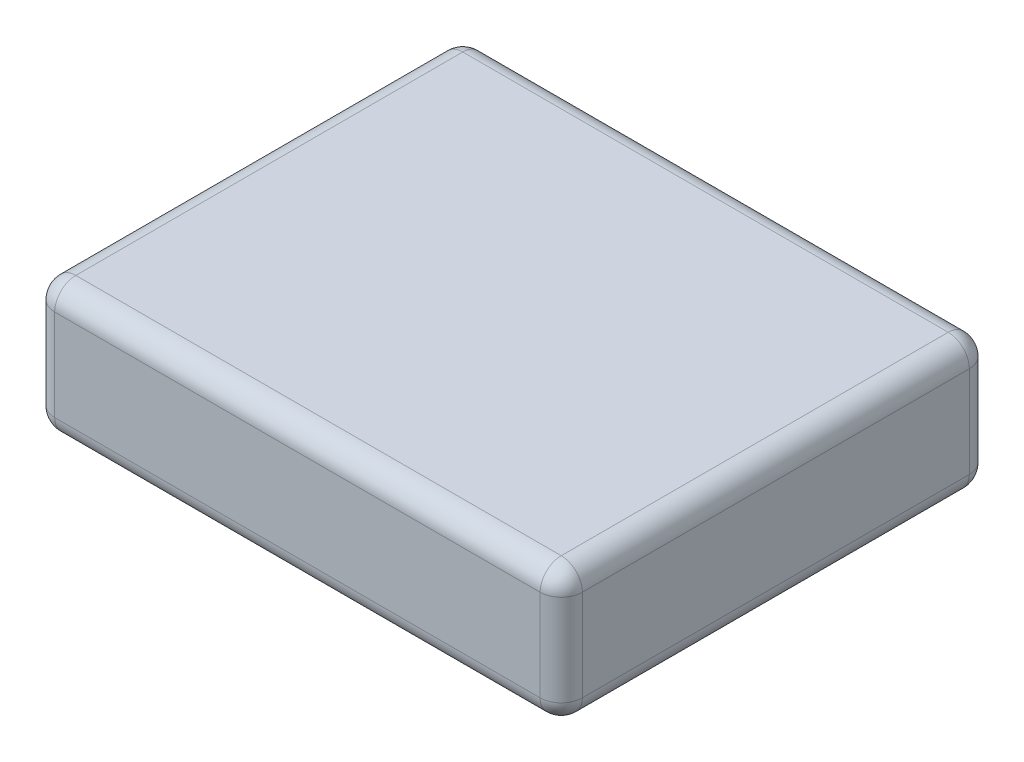
ISO-10303-21;
HEADER;
FILE_DESCRIPTION(('STEP AP214'),'2;1');
FILE_NAME('part.step','',(''),(''),'','','');
FILE_SCHEMA(('AUTOMOTIVE_DESIGN { 1 0 10303 214 1 1 1 1 }'));
ENDSEC;
DATA;
#1=APPLICATION_CONTEXT('core data for automotive mechanical design processes');
#2=APPLICATION_PROTOCOL_DEFINITION('international standard','automotive_design',2000,#1);
#3=PRODUCT_CONTEXT('',#1,'mechanical');
#4=PRODUCT('Part','Part','',(#3));
#5=PRODUCT_RELATED_PRODUCT_CATEGORY('part','',(#4));
#6=PRODUCT_DEFINITION_FORMATION('','',#4);
#7=PRODUCT_DEFINITION_CONTEXT('part definition',#1,'design');
#8=PRODUCT_DEFINITION('design','',#6,#7);
#9=PRODUCT_DEFINITION_SHAPE('','',#8);
#10=(LENGTH_UNIT() NAMED_UNIT(*) SI_UNIT(.MILLI.,.METRE.));
#11=(NAMED_UNIT(*) PLANE_ANGLE_UNIT() SI_UNIT($,.RADIAN.));
#12=(NAMED_UNIT(*) SI_UNIT($,.STERADIAN.) SOLID_ANGLE_UNIT());
#13=UNCERTAINTY_MEASURE_WITH_UNIT(LENGTH_MEASURE(1.E-05),#10,'distance_accuracy_value','');
#14=(GEOMETRIC_REPRESENTATION_CONTEXT(3) GLOBAL_UNCERTAINTY_ASSIGNED_CONTEXT((#13)) GLOBAL_UNIT_ASSIGNED_CONTEXT((#10,
#11,#12)) REPRESENTATION_CONTEXT('',''));
#15=CARTESIAN_POINT('',(0.,0.,0.));
#16=DIRECTION('',(0.,0.,1.));
#17=DIRECTION('',(1.,0.,0.));
#18=AXIS2_PLACEMENT_3D('',#15,#16,#17);
#19=CARTESIAN_POINT('',(-37.5,19.,-30.5));
#20=DIRECTION('',(1.,0.,0.));
#21=DIRECTION('',(0.,0.,-1.));
#22=AXIS2_PLACEMENT_3D('',#19,#20,#21);
#23=PLANE('',#22);
#24=DIRECTION('',(0.,-1.,0.));
#25=VECTOR('',#24,1.);
#26=CARTESIAN_POINT('',(-37.5,19.,-27.5));
#27=LINE('',#26,#25);
#28=CARTESIAN_POINT('',(-37.5,16.,-27.5));
#29=VERTEX_POINT('',#28);
#30=CARTESIAN_POINT('',(-37.5,3.,-27.5));
#31=VERTEX_POINT('',#30);
#32=EDGE_CURVE('E139',#29,#31,#27,.T.);
#33=ORIENTED_EDGE('',*,*,#32,.T.);
#34=DIRECTION('',(0.,0.,1.));
#35=VECTOR('',#34,1.);
#36=CARTESIAN_POINT('',(-37.5,3.,-30.5));
#37=LINE('',#36,#35);
#38=CARTESIAN_POINT('',(-37.5,3.,27.5));
#39=VERTEX_POINT('',#38);
#40=EDGE_CURVE('E134',#31,#39,#37,.T.);
#41=ORIENTED_EDGE('',*,*,#40,.T.);
#42=DIRECTION('',(0.,-1.,0.));
#43=VECTOR('',#42,1.);
#44=CARTESIAN_POINT('',(-37.5,19.,27.5));
#45=LINE('',#44,#43);
#46=CARTESIAN_POINT('',(-37.5,16.,27.5));
#47=VERTEX_POINT('',#46);
#48=EDGE_CURVE('E127',#39,#47,#45,.F.);
#49=ORIENTED_EDGE('',*,*,#48,.T.);
#50=DIRECTION('',(0.,0.,1.));
#51=VECTOR('',#50,1.);
#52=CARTESIAN_POINT('',(-37.5,16.,-30.5));
#53=LINE('',#52,#51);
#54=EDGE_CURVE('E131',#47,#29,#53,.F.);
#55=ORIENTED_EDGE('',*,*,#54,.T.);
#56=EDGE_LOOP('',(#33,#41,#49,#55));
#57=FACE_BOUND('',#56,.T.);
#58=ADVANCED_FACE('F39',(#57),#23,.F.);
#59=CARTESIAN_POINT('',(-37.5,19.,30.5));
#60=DIRECTION('',(0.,0.,-1.));
#61=DIRECTION('',(-1.,0.,0.));
#62=AXIS2_PLACEMENT_3D('',#59,#60,#61);
#63=PLANE('',#62);
#64=DIRECTION('',(0.,-1.,0.));
#65=VECTOR('',#64,1.);
#66=CARTESIAN_POINT('',(-34.5,19.,30.5));
#67=LINE('',#66,#65);
#68=CARTESIAN_POINT('',(-34.5,16.,30.5));
#69=VERTEX_POINT('',#68);
#70=CARTESIAN_POINT('',(-34.5,3.,30.5));
#71=VERTEX_POINT('',#70);
#72=EDGE_CURVE('E147',#69,#71,#67,.T.);
#73=ORIENTED_EDGE('',*,*,#72,.T.);
#74=DIRECTION('',(1.,0.,0.));
#75=VECTOR('',#74,1.);
#76=CARTESIAN_POINT('',(-37.5,3.,30.5));
#77=LINE('',#76,#75);
#78=CARTESIAN_POINT('',(34.5,3.,30.5));
#79=VERTEX_POINT('',#78);
#80=EDGE_CURVE('E199',#71,#79,#77,.T.);
#81=ORIENTED_EDGE('',*,*,#80,.T.);
#82=DIRECTION('',(0.,-1.,0.));
#83=VECTOR('',#82,1.);
#84=CARTESIAN_POINT('',(34.5,19.,30.5));
#85=LINE('',#84,#83);
#86=CARTESIAN_POINT('',(34.5,16.,30.5));
#87=VERTEX_POINT('',#86);
#88=EDGE_CURVE('E194',#79,#87,#85,.F.);
#89=ORIENTED_EDGE('',*,*,#88,.T.);
#90=DIRECTION('',(1.,0.,0.));
#91=VECTOR('',#90,1.);
#92=CARTESIAN_POINT('',(-37.5,16.,30.5));
#93=LINE('',#92,#91);
#94=EDGE_CURVE('E191',#87,#69,#93,.F.);
#95=ORIENTED_EDGE('',*,*,#94,.T.);
#96=EDGE_LOOP('',(#73,#81,#89,#95));
#97=FACE_BOUND('',#96,.T.);
#98=ADVANCED_FACE('F354',(#97),#63,.F.);
#99=CARTESIAN_POINT('',(37.5,19.,-30.5));
#100=DIRECTION('',(-1.,0.,0.));
#101=DIRECTION('',(0.,0.,1.));
#102=AXIS2_PLACEMENT_3D('',#99,#100,#101);
#103=PLANE('',#102);
#104=DIRECTION('',(0.,-1.,0.));
#105=VECTOR('',#104,1.);
#106=CARTESIAN_POINT('',(37.5,19.,-27.5));
#107=LINE('',#106,#105);
#108=CARTESIAN_POINT('',(37.5,3.,-27.5));
#109=VERTEX_POINT('',#108);
#110=CARTESIAN_POINT('',(37.5,16.,-27.5));
#111=VERTEX_POINT('',#110);
#112=EDGE_CURVE('E205',#109,#111,#107,.F.);
#113=ORIENTED_EDGE('',*,*,#112,.T.);
#114=DIRECTION('',(0.,0.,-1.));
#115=VECTOR('',#114,1.);
#116=CARTESIAN_POINT('',(37.5,16.,30.5));
#117=LINE('',#116,#115);
#118=CARTESIAN_POINT('',(37.5,16.,27.5));
#119=VERTEX_POINT('',#118);
#120=EDGE_CURVE('E212',#111,#119,#117,.F.);
#121=ORIENTED_EDGE('',*,*,#120,.T.);
#122=DIRECTION('',(0.,-1.,0.));
#123=VECTOR('',#122,1.);
#124=CARTESIAN_POINT('',(37.5,19.,27.5));
#125=LINE('',#124,#123);
#126=CARTESIAN_POINT('',(37.5,3.,27.5));
#127=VERTEX_POINT('',#126);
#128=EDGE_CURVE('E208',#119,#127,#125,.T.);
#129=ORIENTED_EDGE('',*,*,#128,.T.);
#130=DIRECTION('',(0.,0.,-1.));
#131=VECTOR('',#130,1.);
#132=CARTESIAN_POINT('',(37.5,3.,-30.5));
#133=LINE('',#132,#131);
#134=EDGE_CURVE('E202',#127,#109,#133,.T.);
#135=ORIENTED_EDGE('',*,*,#134,.T.);
#136=EDGE_LOOP('',(#113,#121,#129,#135));
#137=FACE_BOUND('',#136,.T.);
#138=ADVANCED_FACE('F342',(#137),#103,.F.);
#139=CARTESIAN_POINT('',(-37.5,19.,-30.5));
#140=DIRECTION('',(0.,0.,1.));
#141=DIRECTION('',(1.,0.,0.));
#142=AXIS2_PLACEMENT_3D('',#139,#140,#141);
#143=PLANE('',#142);
#144=DIRECTION('',(0.,-1.,0.));
#145=VECTOR('',#144,1.);
#146=CARTESIAN_POINT('',(34.5,19.,-30.5));
#147=LINE('',#146,#145);
#148=CARTESIAN_POINT('',(34.5,16.,-30.5));
#149=VERTEX_POINT('',#148);
#150=CARTESIAN_POINT('',(34.5,3.,-30.5));
#151=VERTEX_POINT('',#150);
#152=EDGE_CURVE('E181',#149,#151,#147,.T.);
#153=ORIENTED_EDGE('',*,*,#152,.T.);
#154=DIRECTION('',(-1.,0.,0.));
#155=VECTOR('',#154,1.);
#156=CARTESIAN_POINT('',(-37.5,3.,-30.5));
#157=LINE('',#156,#155);
#158=CARTESIAN_POINT('',(-34.5,3.,-30.5));
#159=VERTEX_POINT('',#158);
#160=EDGE_CURVE('E188',#151,#159,#157,.T.);
#161=ORIENTED_EDGE('',*,*,#160,.T.);
#162=DIRECTION('',(0.,-1.,0.));
#163=VECTOR('',#162,1.);
#164=CARTESIAN_POINT('',(-34.5,19.,-30.5));
#165=LINE('',#164,#163);
#166=CARTESIAN_POINT('',(-34.5,16.,-30.5));
#167=VERTEX_POINT('',#166);
#168=EDGE_CURVE('E184',#159,#167,#165,.F.);
#169=ORIENTED_EDGE('',*,*,#168,.T.);
#170=DIRECTION('',(-1.,0.,0.));
#171=VECTOR('',#170,1.);
#172=CARTESIAN_POINT('',(37.5,16.,-30.5));
#173=LINE('',#172,#171);
#174=EDGE_CURVE('E178',#167,#149,#173,.F.);
#175=ORIENTED_EDGE('',*,*,#174,.T.);
#176=EDGE_LOOP('',(#153,#161,#169,#175));
#177=FACE_BOUND('',#176,.T.);
#178=ADVANCED_FACE('F333',(#177),#143,.F.);
#179=CARTESIAN_POINT('',(0.,19.,0.));
#180=DIRECTION('',(0.,1.,0.));
#181=DIRECTION('',(0.,0.,1.));
#182=AXIS2_PLACEMENT_3D('',#179,#180,#181);
#183=PLANE('',#182);
#184=DIRECTION('',(0.,0.,1.));
#185=VECTOR('',#184,1.);
#186=CARTESIAN_POINT('',(-34.5,19.,30.5));
#187=LINE('',#186,#185);
#188=CARTESIAN_POINT('',(-34.5,19.,-27.5));
#189=VERTEX_POINT('',#188);
#190=CARTESIAN_POINT('',(-34.5,19.,27.5));
#191=VERTEX_POINT('',#190);
#192=EDGE_CURVE('E218',#189,#191,#187,.T.);
#193=ORIENTED_EDGE('',*,*,#192,.T.);
#194=DIRECTION('',(1.,0.,0.));
#195=VECTOR('',#194,1.);
#196=CARTESIAN_POINT('',(37.5,19.,27.5));
#197=LINE('',#196,#195);
#198=CARTESIAN_POINT('',(34.5,19.,27.5));
#199=VERTEX_POINT('',#198);
#200=EDGE_CURVE('E225',#191,#199,#197,.T.);
#201=ORIENTED_EDGE('',*,*,#200,.T.);
#202=DIRECTION('',(0.,0.,-1.));
#203=VECTOR('',#202,1.);
#204=CARTESIAN_POINT('',(34.5,19.,-30.5));
#205=LINE('',#204,#203);
#206=CARTESIAN_POINT('',(34.5,19.,-27.5));
#207=VERTEX_POINT('',#206);
#208=EDGE_CURVE('E221',#199,#207,#205,.T.);
#209=ORIENTED_EDGE('',*,*,#208,.T.);
#210=DIRECTION('',(-1.,0.,0.));
#211=VECTOR('',#210,1.);
#212=CARTESIAN_POINT('',(-37.5,19.,-27.5));
#213=LINE('',#212,#211);
#214=EDGE_CURVE('E215',#207,#189,#213,.T.);
#215=ORIENTED_EDGE('',*,*,#214,.T.);
#216=EDGE_LOOP('',(#193,#201,#209,#215));
#217=FACE_BOUND('',#216,.T.);
#218=ADVANCED_FACE('F359',(#217),#183,.T.);
#219=CARTESIAN_POINT('',(0.,0.,0.));
#220=DIRECTION('',(0.,1.,0.));
#221=DIRECTION('',(0.,0.,1.));
#222=AXIS2_PLACEMENT_3D('',#219,#220,#221);
#223=PLANE('',#222);
#224=DIRECTION('',(0.,0.,1.));
#225=VECTOR('',#224,1.);
#226=CARTESIAN_POINT('',(-34.5,0.,0.));
#227=LINE('',#226,#225);
#228=CARTESIAN_POINT('',(-34.5,0.,27.5));
#229=VERTEX_POINT('',#228);
#230=CARTESIAN_POINT('',(-34.5,0.,-27.5));
#231=VERTEX_POINT('',#230);
#232=EDGE_CURVE('E60',#229,#231,#227,.F.);
#233=ORIENTED_EDGE('',*,*,#232,.T.);
#234=DIRECTION('',(-1.,0.,0.));
#235=VECTOR('',#234,1.);
#236=CARTESIAN_POINT('',(0.,0.,-27.5));
#237=LINE('',#236,#235);
#238=CARTESIAN_POINT('',(34.5,0.,-27.5));
#239=VERTEX_POINT('',#238);
#240=EDGE_CURVE('E11',#231,#239,#237,.F.);
#241=ORIENTED_EDGE('',*,*,#240,.T.);
#242=DIRECTION('',(0.,0.,-1.));
#243=VECTOR('',#242,1.);
#244=CARTESIAN_POINT('',(34.5,0.,0.));
#245=LINE('',#244,#243);
#246=CARTESIAN_POINT('',(34.5,0.,27.5));
#247=VERTEX_POINT('',#246);
#248=EDGE_CURVE('E49',#239,#247,#245,.F.);
#249=ORIENTED_EDGE('',*,*,#248,.T.);
#250=DIRECTION('',(1.,0.,0.));
#251=VECTOR('',#250,1.);
#252=CARTESIAN_POINT('',(0.,0.,27.5));
#253=LINE('',#252,#251);
#254=EDGE_CURVE('E228',#247,#229,#253,.F.);
#255=ORIENTED_EDGE('',*,*,#254,.T.);
#256=EDGE_LOOP('',(#233,#241,#249,#255));
#257=FACE_BOUND('',#256,.T.);
#258=ADVANCED_FACE('F318',(#257),#223,.F.);
#259=CARTESIAN_POINT('',(34.5,19.,27.5));
#260=DIRECTION('',(0.,-1.,0.));
#261=DIRECTION('',(0.,0.,-1.));
#262=AXIS2_PLACEMENT_3D('',#259,#260,#261);
#263=CYLINDRICAL_SURFACE('',#262,3.);
#264=CARTESIAN_POINT('',(34.5,16.,27.5));
#265=DIRECTION('',(0.,1.,0.));
#266=DIRECTION('',(0.,0.,1.));
#267=AXIS2_PLACEMENT_3D('',#264,#265,#266);
#268=CIRCLE('',#267,3.);
#269=EDGE_CURVE('E43',#87,#119,#268,.T.);
#270=ORIENTED_EDGE('',*,*,#269,.F.);
#271=ORIENTED_EDGE('',*,*,#88,.F.);
#272=CARTESIAN_POINT('',(34.5,3.,27.5));
#273=DIRECTION('',(0.,-1.,0.));
#274=DIRECTION('',(0.,0.,-1.));
#275=AXIS2_PLACEMENT_3D('',#272,#273,#274);
#276=CIRCLE('',#275,3.);
#277=EDGE_CURVE('E172',#127,#79,#276,.T.);
#278=ORIENTED_EDGE('',*,*,#277,.F.);
#279=ORIENTED_EDGE('',*,*,#128,.F.);
#280=EDGE_LOOP('',(#270,#271,#278,#279));
#281=FACE_BOUND('',#280,.T.);
#282=ADVANCED_FACE('F41',(#281),#263,.T.);
#283=CARTESIAN_POINT('',(34.5,16.,27.5));
#284=DIRECTION('',(0.,0.,1.));
#285=DIRECTION('',(1.,0.,0.));
#286=AXIS2_PLACEMENT_3D('',#283,#284,#285);
#287=SPHERICAL_SURFACE('',#286,3.);
#288=CARTESIAN_POINT('',(34.5,16.,27.5));
#289=DIRECTION('',(1.,0.,0.));
#290=DIRECTION('',(0.,0.,-1.));
#291=AXIS2_PLACEMENT_3D('',#288,#289,#290);
#292=CIRCLE('',#291,3.);
#293=EDGE_CURVE('E296',#87,#199,#292,.F.);
#294=ORIENTED_EDGE('',*,*,#293,.F.);
#295=ORIENTED_EDGE('',*,*,#269,.T.);
#296=CARTESIAN_POINT('',(34.5,16.,27.5));
#297=DIRECTION('',(0.,0.,1.));
#298=DIRECTION('',(0.,-1.,0.));
#299=AXIS2_PLACEMENT_3D('',#296,#297,#298);
#300=CIRCLE('',#299,3.);
#301=EDGE_CURVE('E300',#199,#119,#300,.F.);
#302=ORIENTED_EDGE('',*,*,#301,.F.);
#303=EDGE_LOOP('',(#294,#295,#302));
#304=FACE_BOUND('',#303,.T.);
#305=ADVANCED_FACE('F350',(#304),#287,.T.);
#306=CARTESIAN_POINT('',(34.5,3.,27.5));
#307=DIRECTION('',(0.,0.,1.));
#308=DIRECTION('',(1.,0.,0.));
#309=AXIS2_PLACEMENT_3D('',#306,#307,#308);
#310=SPHERICAL_SURFACE('',#309,3.);
#311=CARTESIAN_POINT('',(34.5,3.,27.5));
#312=DIRECTION('',(0.,0.,1.));
#313=DIRECTION('',(1.,0.,0.));
#314=AXIS2_PLACEMENT_3D('',#311,#312,#313);
#315=CIRCLE('',#314,3.);
#316=EDGE_CURVE('E288',#127,#247,#315,.F.);
#317=ORIENTED_EDGE('',*,*,#316,.F.);
#318=ORIENTED_EDGE('',*,*,#277,.T.);
#319=CARTESIAN_POINT('',(34.5,3.,27.5));
#320=DIRECTION('',(1.,0.,0.));
#321=DIRECTION('',(0.,0.,-1.));
#322=AXIS2_PLACEMENT_3D('',#319,#320,#321);
#323=CIRCLE('',#322,3.);
#324=EDGE_CURVE('E292',#247,#79,#323,.F.);
#325=ORIENTED_EDGE('',*,*,#324,.F.);
#326=EDGE_LOOP('',(#317,#318,#325));
#327=FACE_BOUND('',#326,.T.);
#328=ADVANCED_FACE('F309',(#327),#310,.T.);
#329=CARTESIAN_POINT('',(34.5,16.,0.));
#330=DIRECTION('',(0.,0.,1.));
#331=DIRECTION('',(1.,0.,0.));
#332=AXIS2_PLACEMENT_3D('',#329,#330,#331);
#333=CYLINDRICAL_SURFACE('',#332,3.);
#334=ORIENTED_EDGE('',*,*,#301,.T.);
#335=ORIENTED_EDGE('',*,*,#120,.F.);
#336=CARTESIAN_POINT('',(34.5,16.,-27.5));
#337=DIRECTION('',(0.,0.,-1.));
#338=DIRECTION('',(-1.,0.,0.));
#339=AXIS2_PLACEMENT_3D('',#336,#337,#338);
#340=CIRCLE('',#339,3.);
#341=EDGE_CURVE('E280',#207,#111,#340,.T.);
#342=ORIENTED_EDGE('',*,*,#341,.F.);
#343=ORIENTED_EDGE('',*,*,#208,.F.);
#344=EDGE_LOOP('',(#334,#335,#342,#343));
#345=FACE_BOUND('',#344,.T.);
#346=ADVANCED_FACE('F345',(#345),#333,.T.);
#347=CARTESIAN_POINT('',(0.,16.,27.5));
#348=DIRECTION('',(-1.,0.,0.));
#349=DIRECTION('',(0.,0.,1.));
#350=AXIS2_PLACEMENT_3D('',#347,#348,#349);
#351=CYLINDRICAL_SURFACE('',#350,3.);
#352=ORIENTED_EDGE('',*,*,#293,.T.);
#353=ORIENTED_EDGE('',*,*,#200,.F.);
#354=CARTESIAN_POINT('',(-34.5,16.,27.5));
#355=DIRECTION('',(-1.,0.,0.));
#356=DIRECTION('',(0.,0.,1.));
#357=AXIS2_PLACEMENT_3D('',#354,#355,#356);
#358=CIRCLE('',#357,3.);
#359=EDGE_CURVE('E152',#69,#191,#358,.T.);
#360=ORIENTED_EDGE('',*,*,#359,.F.);
#361=ORIENTED_EDGE('',*,*,#94,.F.);
#362=EDGE_LOOP('',(#352,#353,#360,#361));
#363=FACE_BOUND('',#362,.T.);
#364=ADVANCED_FACE('F356',(#363),#351,.T.);
#365=CARTESIAN_POINT('',(-34.5,19.,27.5));
#366=DIRECTION('',(0.,-1.,0.));
#367=DIRECTION('',(0.,0.,-1.));
#368=AXIS2_PLACEMENT_3D('',#365,#366,#367);
#369=CYLINDRICAL_SURFACE('',#368,3.);
#370=CARTESIAN_POINT('',(-34.5,3.,27.5));
#371=DIRECTION('',(0.,-1.,0.));
#372=DIRECTION('',(0.,0.,-1.));
#373=AXIS2_PLACEMENT_3D('',#370,#371,#372);
#374=CIRCLE('',#373,3.);
#375=EDGE_CURVE('E153',#71,#39,#374,.T.);
#376=ORIENTED_EDGE('',*,*,#375,.F.);
#377=ORIENTED_EDGE('',*,*,#72,.F.);
#378=CARTESIAN_POINT('',(-34.5,16.,27.5));
#379=DIRECTION('',(0.,1.,0.));
#380=DIRECTION('',(0.,0.,1.));
#381=AXIS2_PLACEMENT_3D('',#378,#379,#380);
#382=CIRCLE('',#381,3.);
#383=EDGE_CURVE('E143',#47,#69,#382,.T.);
#384=ORIENTED_EDGE('',*,*,#383,.F.);
#385=ORIENTED_EDGE('',*,*,#48,.F.);
#386=EDGE_LOOP('',(#376,#377,#384,#385));
#387=FACE_BOUND('',#386,.T.);
#388=ADVANCED_FACE('F145',(#387),#369,.T.);
#389=CARTESIAN_POINT('',(-37.5,3.,27.5));
#390=DIRECTION('',(1.,0.,0.));
#391=DIRECTION('',(0.,0.,-1.));
#392=AXIS2_PLACEMENT_3D('',#389,#390,#391);
#393=CYLINDRICAL_SURFACE('',#392,3.);
#394=ORIENTED_EDGE('',*,*,#324,.T.);
#395=ORIENTED_EDGE('',*,*,#80,.F.);
#396=CARTESIAN_POINT('',(-34.5,3.,27.5));
#397=DIRECTION('',(-1.,0.,0.));
#398=DIRECTION('',(0.,0.,1.));
#399=AXIS2_PLACEMENT_3D('',#396,#397,#398);
#400=CIRCLE('',#399,3.);
#401=EDGE_CURVE('E273',#229,#71,#400,.T.);
#402=ORIENTED_EDGE('',*,*,#401,.F.);
#403=ORIENTED_EDGE('',*,*,#254,.F.);
#404=EDGE_LOOP('',(#394,#395,#402,#403));
#405=FACE_BOUND('',#404,.T.);
#406=ADVANCED_FACE('F315',(#405),#393,.T.);
#407=CARTESIAN_POINT('',(34.5,3.,-30.5));
#408=DIRECTION('',(0.,0.,-1.));
#409=DIRECTION('',(-1.,0.,0.));
#410=AXIS2_PLACEMENT_3D('',#407,#408,#409);
#411=CYLINDRICAL_SURFACE('',#410,3.);
#412=ORIENTED_EDGE('',*,*,#316,.T.);
#413=ORIENTED_EDGE('',*,*,#248,.F.);
#414=CARTESIAN_POINT('',(34.5,3.,-27.5));
#415=DIRECTION('',(0.,0.,-1.));
#416=DIRECTION('',(-1.,0.,0.));
#417=AXIS2_PLACEMENT_3D('',#414,#415,#416);
#418=CIRCLE('',#417,3.);
#419=EDGE_CURVE('E269',#109,#239,#418,.T.);
#420=ORIENTED_EDGE('',*,*,#419,.F.);
#421=ORIENTED_EDGE('',*,*,#134,.F.);
#422=EDGE_LOOP('',(#412,#413,#420,#421));
#423=FACE_BOUND('',#422,.T.);
#424=ADVANCED_FACE('F321',(#423),#411,.T.);
#425=CARTESIAN_POINT('',(34.5,19.,-27.5));
#426=DIRECTION('',(0.,-1.,0.));
#427=DIRECTION('',(0.,0.,-1.));
#428=AXIS2_PLACEMENT_3D('',#425,#426,#427);
#429=CYLINDRICAL_SURFACE('',#428,3.);
#430=CARTESIAN_POINT('',(34.5,16.,-27.5));
#431=DIRECTION('',(0.,1.,0.));
#432=DIRECTION('',(0.,0.,1.));
#433=AXIS2_PLACEMENT_3D('',#430,#431,#432);
#434=CIRCLE('',#433,3.);
#435=EDGE_CURVE('E284',#111,#149,#434,.T.);
#436=ORIENTED_EDGE('',*,*,#435,.F.);
#437=ORIENTED_EDGE('',*,*,#112,.F.);
#438=CARTESIAN_POINT('',(34.5,3.,-27.5));
#439=DIRECTION('',(0.,-1.,0.));
#440=DIRECTION('',(0.,0.,-1.));
#441=AXIS2_PLACEMENT_3D('',#438,#439,#440);
#442=CIRCLE('',#441,3.);
#443=EDGE_CURVE('E265',#151,#109,#442,.T.);
#444=ORIENTED_EDGE('',*,*,#443,.F.);
#445=ORIENTED_EDGE('',*,*,#152,.F.);
#446=EDGE_LOOP('',(#436,#437,#444,#445));
#447=FACE_BOUND('',#446,.T.);
#448=ADVANCED_FACE('F339',(#447),#429,.T.);
#449=CARTESIAN_POINT('',(34.5,16.,-27.5));
#450=DIRECTION('',(0.,0.,1.));
#451=DIRECTION('',(1.,0.,0.));
#452=AXIS2_PLACEMENT_3D('',#449,#450,#451);
#453=SPHERICAL_SURFACE('',#452,3.);
#454=ORIENTED_EDGE('',*,*,#341,.T.);
#455=ORIENTED_EDGE('',*,*,#435,.T.);
#456=CARTESIAN_POINT('',(34.5,16.,-27.5));
#457=DIRECTION('',(1.,0.,0.));
#458=DIRECTION('',(0.,0.,-1.));
#459=AXIS2_PLACEMENT_3D('',#456,#457,#458);
#460=CIRCLE('',#459,3.);
#461=EDGE_CURVE('E161',#207,#149,#460,.F.);
#462=ORIENTED_EDGE('',*,*,#461,.F.);
#463=EDGE_LOOP('',(#454,#455,#462));
#464=FACE_BOUND('',#463,.T.);
#465=ADVANCED_FACE('F383',(#464),#453,.T.);
#466=CARTESIAN_POINT('',(-34.5,16.,27.5));
#467=DIRECTION('',(0.,0.,1.));
#468=DIRECTION('',(1.,0.,0.));
#469=AXIS2_PLACEMENT_3D('',#466,#467,#468);
#470=SPHERICAL_SURFACE('',#469,3.);
#471=ORIENTED_EDGE('',*,*,#383,.T.);
#472=ORIENTED_EDGE('',*,*,#359,.T.);
#473=CARTESIAN_POINT('',(-34.5,16.,27.5));
#474=DIRECTION('',(0.,0.,1.));
#475=DIRECTION('',(1.,0.,0.));
#476=AXIS2_PLACEMENT_3D('',#473,#474,#475);
#477=CIRCLE('',#476,3.);
#478=EDGE_CURVE('E156',#47,#191,#477,.F.);
#479=ORIENTED_EDGE('',*,*,#478,.F.);
#480=EDGE_LOOP('',(#471,#472,#479));
#481=FACE_BOUND('',#480,.T.);
#482=ADVANCED_FACE('F157',(#481),#470,.T.);
#483=CARTESIAN_POINT('',(-34.5,3.,27.5));
#484=DIRECTION('',(0.,0.,1.));
#485=DIRECTION('',(1.,0.,0.));
#486=AXIS2_PLACEMENT_3D('',#483,#484,#485);
#487=SPHERICAL_SURFACE('',#486,3.);
#488=ORIENTED_EDGE('',*,*,#401,.T.);
#489=ORIENTED_EDGE('',*,*,#375,.T.);
#490=CARTESIAN_POINT('',(-34.5,3.,27.5));
#491=DIRECTION('',(0.,0.,1.));
#492=DIRECTION('',(1.,0.,0.));
#493=AXIS2_PLACEMENT_3D('',#490,#491,#492);
#494=CIRCLE('',#493,3.);
#495=EDGE_CURVE('E162',#229,#39,#494,.F.);
#496=ORIENTED_EDGE('',*,*,#495,.F.);
#497=EDGE_LOOP('',(#488,#489,#496));
#498=FACE_BOUND('',#497,.T.);
#499=ADVANCED_FACE('F375',(#498),#487,.T.);
#500=CARTESIAN_POINT('',(34.5,3.,-27.5));
#501=DIRECTION('',(0.,0.,1.));
#502=DIRECTION('',(1.,0.,0.));
#503=AXIS2_PLACEMENT_3D('',#500,#501,#502);
#504=SPHERICAL_SURFACE('',#503,3.);
#505=ORIENTED_EDGE('',*,*,#443,.T.);
#506=ORIENTED_EDGE('',*,*,#419,.T.);
#507=CARTESIAN_POINT('',(34.5,3.,-27.5));
#508=DIRECTION('',(1.,0.,0.));
#509=DIRECTION('',(0.,0.,-1.));
#510=AXIS2_PLACEMENT_3D('',#507,#508,#509);
#511=CIRCLE('',#510,3.);
#512=EDGE_CURVE('E255',#151,#239,#511,.F.);
#513=ORIENTED_EDGE('',*,*,#512,.F.);
#514=EDGE_LOOP('',(#505,#506,#513));
#515=FACE_BOUND('',#514,.T.);
#516=ADVANCED_FACE('F324',(#515),#504,.T.);
#517=CARTESIAN_POINT('',(0.,16.,-27.5));
#518=DIRECTION('',(1.,0.,0.));
#519=DIRECTION('',(0.,0.,-1.));
#520=AXIS2_PLACEMENT_3D('',#517,#518,#519);
#521=CYLINDRICAL_SURFACE('',#520,3.);
#522=ORIENTED_EDGE('',*,*,#461,.T.);
#523=ORIENTED_EDGE('',*,*,#174,.F.);
#524=CARTESIAN_POINT('',(-34.5,16.,-27.5));
#525=DIRECTION('',(-1.,0.,0.));
#526=DIRECTION('',(0.,0.,1.));
#527=AXIS2_PLACEMENT_3D('',#524,#525,#526);
#528=CIRCLE('',#527,3.);
#529=EDGE_CURVE('E251',#189,#167,#528,.T.);
#530=ORIENTED_EDGE('',*,*,#529,.F.);
#531=ORIENTED_EDGE('',*,*,#214,.F.);
#532=EDGE_LOOP('',(#522,#523,#530,#531));
#533=FACE_BOUND('',#532,.T.);
#534=ADVANCED_FACE('F362',(#533),#521,.T.);
#535=CARTESIAN_POINT('',(-34.5,16.,0.));
#536=DIRECTION('',(0.,0.,-1.));
#537=DIRECTION('',(-1.,0.,0.));
#538=AXIS2_PLACEMENT_3D('',#535,#536,#537);
#539=CYLINDRICAL_SURFACE('',#538,3.);
#540=ORIENTED_EDGE('',*,*,#478,.T.);
#541=ORIENTED_EDGE('',*,*,#192,.F.);
#542=CARTESIAN_POINT('',(-34.5,16.,-27.5));
#543=DIRECTION('',(0.,0.,-1.));
#544=DIRECTION('',(0.,1.,0.));
#545=AXIS2_PLACEMENT_3D('',#542,#543,#544);
#546=CIRCLE('',#545,3.);
#547=EDGE_CURVE('E166',#29,#189,#546,.T.);
#548=ORIENTED_EDGE('',*,*,#547,.F.);
#549=ORIENTED_EDGE('',*,*,#54,.F.);
#550=EDGE_LOOP('',(#540,#541,#548,#549));
#551=FACE_BOUND('',#550,.T.);
#552=ADVANCED_FACE('F164',(#551),#539,.T.);
#553=CARTESIAN_POINT('',(-34.5,3.,-30.5));
#554=DIRECTION('',(0.,0.,1.));
#555=DIRECTION('',(1.,0.,0.));
#556=AXIS2_PLACEMENT_3D('',#553,#554,#555);
#557=CYLINDRICAL_SURFACE('',#556,3.);
#558=ORIENTED_EDGE('',*,*,#495,.T.);
#559=ORIENTED_EDGE('',*,*,#40,.F.);
#560=CARTESIAN_POINT('',(-34.5,3.,-27.5));
#561=DIRECTION('',(0.,0.,-1.));
#562=DIRECTION('',(-1.,0.,0.));
#563=AXIS2_PLACEMENT_3D('',#560,#561,#562);
#564=CIRCLE('',#563,3.);
#565=EDGE_CURVE('E245',#231,#31,#564,.T.);
#566=ORIENTED_EDGE('',*,*,#565,.F.);
#567=ORIENTED_EDGE('',*,*,#232,.F.);
#568=EDGE_LOOP('',(#558,#559,#566,#567));
#569=FACE_BOUND('',#568,.T.);
#570=ADVANCED_FACE('F373',(#569),#557,.T.);
#571=CARTESIAN_POINT('',(-37.5,3.,-27.5));
#572=DIRECTION('',(-1.,0.,0.));
#573=DIRECTION('',(0.,0.,1.));
#574=AXIS2_PLACEMENT_3D('',#571,#572,#573);
#575=CYLINDRICAL_SURFACE('',#574,3.);
#576=ORIENTED_EDGE('',*,*,#512,.T.);
#577=ORIENTED_EDGE('',*,*,#240,.F.);
#578=CARTESIAN_POINT('',(-34.5,3.,-27.5));
#579=DIRECTION('',(-1.,0.,0.));
#580=DIRECTION('',(0.,0.,1.));
#581=AXIS2_PLACEMENT_3D('',#578,#579,#580);
#582=CIRCLE('',#581,3.);
#583=EDGE_CURVE('E241',#159,#231,#582,.T.);
#584=ORIENTED_EDGE('',*,*,#583,.F.);
#585=ORIENTED_EDGE('',*,*,#160,.F.);
#586=EDGE_LOOP('',(#576,#577,#584,#585));
#587=FACE_BOUND('',#586,.T.);
#588=ADVANCED_FACE('F328',(#587),#575,.T.);
#589=CARTESIAN_POINT('',(-34.5,16.,-27.5));
#590=DIRECTION('',(0.,0.,1.));
#591=DIRECTION('',(1.,0.,0.));
#592=AXIS2_PLACEMENT_3D('',#589,#590,#591);
#593=SPHERICAL_SURFACE('',#592,3.);
#594=ORIENTED_EDGE('',*,*,#547,.T.);
#595=ORIENTED_EDGE('',*,*,#529,.T.);
#596=CARTESIAN_POINT('',(-34.5,16.,-27.5));
#597=DIRECTION('',(0.,1.,0.));
#598=DIRECTION('',(0.,0.,1.));
#599=AXIS2_PLACEMENT_3D('',#596,#597,#598);
#600=CIRCLE('',#599,3.);
#601=EDGE_CURVE('E238',#29,#167,#600,.F.);
#602=ORIENTED_EDGE('',*,*,#601,.F.);
#603=EDGE_LOOP('',(#594,#595,#602));
#604=FACE_BOUND('',#603,.T.);
#605=ADVANCED_FACE('F365',(#604),#593,.T.);
#606=CARTESIAN_POINT('',(-34.5,3.,-27.5));
#607=DIRECTION('',(0.,0.,1.));
#608=DIRECTION('',(1.,0.,0.));
#609=AXIS2_PLACEMENT_3D('',#606,#607,#608);
#610=SPHERICAL_SURFACE('',#609,3.);
#611=ORIENTED_EDGE('',*,*,#583,.T.);
#612=ORIENTED_EDGE('',*,*,#565,.T.);
#613=CARTESIAN_POINT('',(-34.5,3.,-27.5));
#614=DIRECTION('',(0.,-1.,0.));
#615=DIRECTION('',(0.,0.,-1.));
#616=AXIS2_PLACEMENT_3D('',#613,#614,#615);
#617=CIRCLE('',#616,3.);
#618=EDGE_CURVE('E235',#159,#31,#617,.F.);
#619=ORIENTED_EDGE('',*,*,#618,.F.);
#620=EDGE_LOOP('',(#611,#612,#619));
#621=FACE_BOUND('',#620,.T.);
#622=ADVANCED_FACE('F371',(#621),#610,.T.);
#623=CARTESIAN_POINT('',(-34.5,19.,-27.5));
#624=DIRECTION('',(0.,-1.,0.));
#625=DIRECTION('',(0.,0.,-1.));
#626=AXIS2_PLACEMENT_3D('',#623,#624,#625);
#627=CYLINDRICAL_SURFACE('',#626,3.);
#628=ORIENTED_EDGE('',*,*,#601,.T.);
#629=ORIENTED_EDGE('',*,*,#168,.F.);
#630=ORIENTED_EDGE('',*,*,#618,.T.);
#631=ORIENTED_EDGE('',*,*,#32,.F.);
#632=EDGE_LOOP('',(#628,#629,#630,#631));
#633=FACE_BOUND('',#632,.T.);
#634=ADVANCED_FACE('F368',(#633),#627,.T.);
#635=CLOSED_SHELL('',(#58,#98,#138,#178,#218,#258,#282,#305,#328,#346,#364,#388,#406,#424,#448,
#465,#482,#499,#516,#534,#552,#570,#588,#605,#622,#634));
#636=MANIFOLD_SOLID_BREP('B2',#635);
#637=ADVANCED_BREP_SHAPE_REPRESENTATION('',(#18,#636),#14);
#638=SHAPE_DEFINITION_REPRESENTATION(#9,#637);
ENDSEC;
END-ISO-10303-21;
